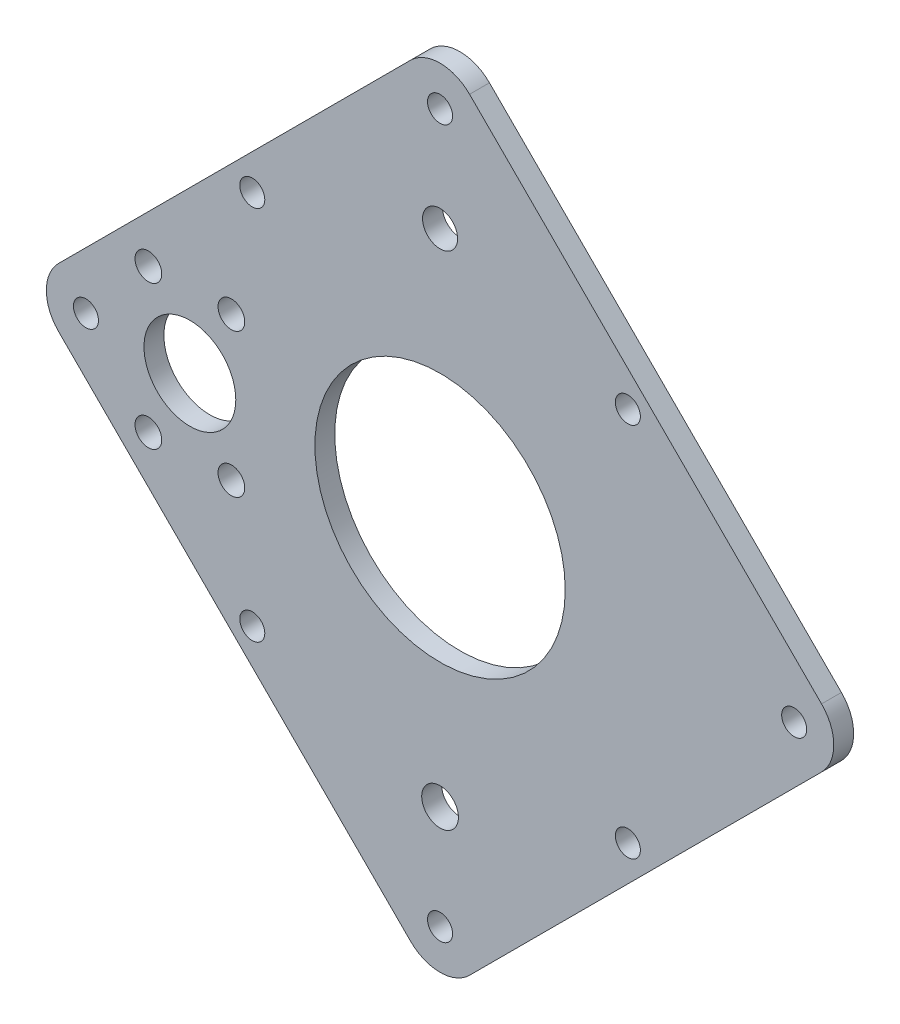
ISO-10303-21;
HEADER;
FILE_DESCRIPTION(('STEP AP214'),'2;1');
FILE_NAME('part.step','',(''),(''),'','','');
FILE_SCHEMA(('AUTOMOTIVE_DESIGN { 1 0 10303 214 1 1 1 1 }'));
ENDSEC;
DATA;
#1=APPLICATION_CONTEXT('core data for automotive mechanical design processes');
#2=APPLICATION_PROTOCOL_DEFINITION('international standard','automotive_design',2000,#1);
#3=PRODUCT_CONTEXT('',#1,'mechanical');
#4=PRODUCT('Part','Part','',(#3));
#5=PRODUCT_RELATED_PRODUCT_CATEGORY('part','',(#4));
#6=PRODUCT_DEFINITION_FORMATION('','',#4);
#7=PRODUCT_DEFINITION_CONTEXT('part definition',#1,'design');
#8=PRODUCT_DEFINITION('design','',#6,#7);
#9=PRODUCT_DEFINITION_SHAPE('','',#8);
#10=(LENGTH_UNIT() NAMED_UNIT(*) SI_UNIT(.MILLI.,.METRE.));
#11=(NAMED_UNIT(*) PLANE_ANGLE_UNIT() SI_UNIT($,.RADIAN.));
#12=(NAMED_UNIT(*) SI_UNIT($,.STERADIAN.) SOLID_ANGLE_UNIT());
#13=UNCERTAINTY_MEASURE_WITH_UNIT(LENGTH_MEASURE(1.E-05),#10,'distance_accuracy_value','');
#14=(GEOMETRIC_REPRESENTATION_CONTEXT(3) GLOBAL_UNCERTAINTY_ASSIGNED_CONTEXT((#13)) GLOBAL_UNIT_ASSIGNED_CONTEXT((#10,
#11,#12)) REPRESENTATION_CONTEXT('',''));
#15=CARTESIAN_POINT('',(0.,0.,0.));
#16=DIRECTION('',(0.,0.,1.));
#17=DIRECTION('',(1.,0.,0.));
#18=AXIS2_PLACEMENT_3D('',#15,#16,#17);
#19=CARTESIAN_POINT('',(24.6213203435596,24.6213203435596,2.38125));
#20=DIRECTION('',(0.707106781186548,0.707106781186548,0.));
#21=DIRECTION('',(-0.707106781186548,0.707106781186548,0.));
#22=AXIS2_PLACEMENT_3D('',#19,#20,#21);
#23=PLANE('',#22);
#24=DIRECTION('',(0.707106781186548,-0.707106781186548,0.));
#25=VECTOR('',#24,1.);
#26=CARTESIAN_POINT('',(24.6213203435596,24.6213203435596,2.38125));
#27=LINE('',#26,#25);
#28=CARTESIAN_POINT('',(3.53553390593274,45.7071067811865,2.38125));
#29=VERTEX_POINT('',#28);
#30=CARTESIAN_POINT('',(45.7071067811865,3.53553390593274,2.38125));
#31=VERTEX_POINT('',#30);
#32=EDGE_CURVE('E279',#29,#31,#27,.T.);
#33=ORIENTED_EDGE('',*,*,#32,.T.);
#34=DIRECTION('',(0.,0.,-1.));
#35=VECTOR('',#34,1.);
#36=CARTESIAN_POINT('',(45.7071067811865,3.53553390593274,2.38125));
#37=LINE('',#36,#35);
#38=CARTESIAN_POINT('',(45.7071067811865,3.53553390593274,0.));
#39=VERTEX_POINT('',#38);
#40=EDGE_CURVE('E10',#31,#39,#37,.T.);
#41=ORIENTED_EDGE('',*,*,#40,.T.);
#42=DIRECTION('',(0.707106781186548,-0.707106781186548,0.));
#43=VECTOR('',#42,1.);
#44=CARTESIAN_POINT('',(24.6213203435596,24.6213203435596,0.));
#45=LINE('',#44,#43);
#46=CARTESIAN_POINT('',(3.53553390593274,45.7071067811865,0.));
#47=VERTEX_POINT('',#46);
#48=EDGE_CURVE('E316',#47,#39,#45,.T.);
#49=ORIENTED_EDGE('',*,*,#48,.F.);
#50=DIRECTION('',(0.,0.,-1.));
#51=VECTOR('',#50,1.);
#52=CARTESIAN_POINT('',(3.53553390593274,45.7071067811865,2.38125));
#53=LINE('',#52,#51);
#54=EDGE_CURVE('E26',#47,#29,#53,.F.);
#55=ORIENTED_EDGE('',*,*,#54,.T.);
#56=EDGE_LOOP('',(#33,#41,#49,#55));
#57=FACE_BOUND('',#56,.T.);
#58=ADVANCED_FACE('F16',(#57),#23,.T.);
#59=CARTESIAN_POINT('',(-24.6213203435596,24.6213203435596,2.38125));
#60=DIRECTION('',(-0.707106781186548,0.707106781186548,0.));
#61=DIRECTION('',(-0.707106781186548,-0.707106781186548,0.));
#62=AXIS2_PLACEMENT_3D('',#59,#60,#61);
#63=PLANE('',#62);
#64=DIRECTION('',(0.707106781186548,0.707106781186548,0.));
#65=VECTOR('',#64,1.);
#66=CARTESIAN_POINT('',(-24.6213203435596,24.6213203435596,0.));
#67=LINE('',#66,#65);
#68=CARTESIAN_POINT('',(-45.7071067811865,3.53553390593274,0.));
#69=VERTEX_POINT('',#68);
#70=CARTESIAN_POINT('',(-3.53553390593274,45.7071067811865,0.));
#71=VERTEX_POINT('',#70);
#72=EDGE_CURVE('E129',#69,#71,#67,.T.);
#73=ORIENTED_EDGE('',*,*,#72,.F.);
#74=DIRECTION('',(0.,0.,-1.));
#75=VECTOR('',#74,1.);
#76=CARTESIAN_POINT('',(-45.7071067811865,3.53553390593274,2.38125));
#77=LINE('',#76,#75);
#78=CARTESIAN_POINT('',(-45.7071067811865,3.53553390593274,2.38125));
#79=VERTEX_POINT('',#78);
#80=EDGE_CURVE('E159',#69,#79,#77,.F.);
#81=ORIENTED_EDGE('',*,*,#80,.T.);
#82=DIRECTION('',(0.707106781186548,0.707106781186548,0.));
#83=VECTOR('',#82,1.);
#84=CARTESIAN_POINT('',(-24.6213203435596,24.6213203435596,2.38125));
#85=LINE('',#84,#83);
#86=CARTESIAN_POINT('',(-3.53553390593274,45.7071067811865,2.38125));
#87=VERTEX_POINT('',#86);
#88=EDGE_CURVE('E249',#79,#87,#85,.T.);
#89=ORIENTED_EDGE('',*,*,#88,.T.);
#90=DIRECTION('',(0.,0.,-1.));
#91=VECTOR('',#90,1.);
#92=CARTESIAN_POINT('',(-3.53553390593274,45.7071067811865,2.38125));
#93=LINE('',#92,#91);
#94=EDGE_CURVE('E155',#87,#71,#93,.T.);
#95=ORIENTED_EDGE('',*,*,#94,.T.);
#96=EDGE_LOOP('',(#73,#81,#89,#95));
#97=FACE_BOUND('',#96,.T.);
#98=ADVANCED_FACE('F350',(#97),#63,.T.);
#99=CARTESIAN_POINT('',(-24.6213203435596,-24.6213203435596,2.38125));
#100=DIRECTION('',(-0.707106781186548,-0.707106781186548,0.));
#101=DIRECTION('',(0.707106781186548,-0.707106781186548,0.));
#102=AXIS2_PLACEMENT_3D('',#99,#100,#101);
#103=PLANE('',#102);
#104=DIRECTION('',(-0.707106781186548,0.707106781186548,0.));
#105=VECTOR('',#104,1.);
#106=CARTESIAN_POINT('',(-24.6213203435596,-24.6213203435596,2.38125));
#107=LINE('',#106,#105);
#108=CARTESIAN_POINT('',(-3.53553390593273,-45.7071067811865,2.38125));
#109=VERTEX_POINT('',#108);
#110=CARTESIAN_POINT('',(-45.7071067811865,-3.53553390593274,2.38125));
#111=VERTEX_POINT('',#110);
#112=EDGE_CURVE('E253',#109,#111,#107,.T.);
#113=ORIENTED_EDGE('',*,*,#112,.T.);
#114=DIRECTION('',(0.,0.,-1.));
#115=VECTOR('',#114,1.);
#116=CARTESIAN_POINT('',(-45.7071067811865,-3.53553390593274,2.38125));
#117=LINE('',#116,#115);
#118=CARTESIAN_POINT('',(-45.7071067811865,-3.53553390593274,0.));
#119=VERTEX_POINT('',#118);
#120=EDGE_CURVE('E126',#111,#119,#117,.T.);
#121=ORIENTED_EDGE('',*,*,#120,.T.);
#122=DIRECTION('',(-0.707106781186548,0.707106781186548,0.));
#123=VECTOR('',#122,1.);
#124=CARTESIAN_POINT('',(-24.6213203435596,-24.6213203435596,0.));
#125=LINE('',#124,#123);
#126=CARTESIAN_POINT('',(-3.53553390593273,-45.7071067811865,0.));
#127=VERTEX_POINT('',#126);
#128=EDGE_CURVE('E110',#127,#119,#125,.T.);
#129=ORIENTED_EDGE('',*,*,#128,.F.);
#130=DIRECTION('',(0.,0.,-1.));
#131=VECTOR('',#130,1.);
#132=CARTESIAN_POINT('',(-3.53553390593273,-45.7071067811865,2.38125));
#133=LINE('',#132,#131);
#134=EDGE_CURVE('E124',#127,#109,#133,.F.);
#135=ORIENTED_EDGE('',*,*,#134,.T.);
#136=EDGE_LOOP('',(#113,#121,#129,#135));
#137=FACE_BOUND('',#136,.T.);
#138=ADVANCED_FACE('F123',(#137),#103,.T.);
#139=CARTESIAN_POINT('',(0.,42.4264068711928,2.38125));
#140=DIRECTION('',(0.,0.,-1.));
#141=DIRECTION('',(-1.,0.,0.));
#142=AXIS2_PLACEMENT_3D('',#139,#140,#141);
#143=CYLINDRICAL_SURFACE('',#142,1.5);
#144=CARTESIAN_POINT('',(0.,42.4264068711928,2.38125));
#145=DIRECTION('',(0.,0.,1.));
#146=DIRECTION('',(1.,0.,0.));
#147=AXIS2_PLACEMENT_3D('',#144,#145,#146);
#148=CIRCLE('',#147,1.5);
#149=CARTESIAN_POINT('',(1.49999999999999,42.4264068711928,2.38125));
#150=VERTEX_POINT('',#149);
#151=EDGE_CURVE('E143',#150,#150,#148,.T.);
#152=ORIENTED_EDGE('',*,*,#151,.T.);
#153=EDGE_LOOP('',(#152));
#154=FACE_BOUND('',#153,.T.);
#155=CARTESIAN_POINT('',(0.,42.4264068711928,0.));
#156=DIRECTION('',(0.,0.,1.));
#157=DIRECTION('',(1.,0.,0.));
#158=AXIS2_PLACEMENT_3D('',#155,#156,#157);
#159=CIRCLE('',#158,1.5);
#160=CARTESIAN_POINT('',(1.49999999999999,42.4264068711928,0.));
#161=VERTEX_POINT('',#160);
#162=EDGE_CURVE('E319',#161,#161,#159,.T.);
#163=ORIENTED_EDGE('',*,*,#162,.F.);
#164=EDGE_LOOP('',(#163));
#165=FACE_BOUND('',#164,.T.);
#166=ADVANCED_FACE('F359',(#154,#165),#143,.F.);
#167=CARTESIAN_POINT('',(42.4264068711928,0.,2.38125));
#168=DIRECTION('',(0.,0.,-1.));
#169=DIRECTION('',(-1.,0.,0.));
#170=AXIS2_PLACEMENT_3D('',#167,#168,#169);
#171=CYLINDRICAL_SURFACE('',#170,1.5);
#172=CARTESIAN_POINT('',(42.4264068711928,0.,2.38125));
#173=DIRECTION('',(0.,0.,1.));
#174=DIRECTION('',(1.,0.,0.));
#175=AXIS2_PLACEMENT_3D('',#172,#173,#174);
#176=CIRCLE('',#175,1.5);
#177=CARTESIAN_POINT('',(43.9264068711928,0.,2.38125));
#178=VERTEX_POINT('',#177);
#179=EDGE_CURVE('E275',#178,#178,#176,.T.);
#180=ORIENTED_EDGE('',*,*,#179,.T.);
#181=EDGE_LOOP('',(#180));
#182=FACE_BOUND('',#181,.T.);
#183=CARTESIAN_POINT('',(42.4264068711928,0.,0.));
#184=DIRECTION('',(0.,0.,1.));
#185=DIRECTION('',(1.,0.,0.));
#186=AXIS2_PLACEMENT_3D('',#183,#184,#185);
#187=CIRCLE('',#186,1.5);
#188=CARTESIAN_POINT('',(43.9264068711928,0.,0.));
#189=VERTEX_POINT('',#188);
#190=EDGE_CURVE('E312',#189,#189,#187,.T.);
#191=ORIENTED_EDGE('',*,*,#190,.F.);
#192=EDGE_LOOP('',(#191));
#193=FACE_BOUND('',#192,.T.);
#194=ADVANCED_FACE('F360',(#182,#193),#171,.F.);
#195=CARTESIAN_POINT('',(0.,-42.4264068711928,2.38125));
#196=DIRECTION('',(0.,0.,-1.));
#197=DIRECTION('',(-1.,0.,0.));
#198=AXIS2_PLACEMENT_3D('',#195,#196,#197);
#199=CYLINDRICAL_SURFACE('',#198,1.5);
#200=CARTESIAN_POINT('',(0.,-42.4264068711928,2.38125));
#201=DIRECTION('',(0.,0.,1.));
#202=DIRECTION('',(1.,0.,0.));
#203=AXIS2_PLACEMENT_3D('',#200,#201,#202);
#204=CIRCLE('',#203,1.5);
#205=CARTESIAN_POINT('',(1.50000000000002,-42.4264068711928,2.38125));
#206=VERTEX_POINT('',#205);
#207=EDGE_CURVE('E271',#206,#206,#204,.T.);
#208=ORIENTED_EDGE('',*,*,#207,.T.);
#209=EDGE_LOOP('',(#208));
#210=FACE_BOUND('',#209,.T.);
#211=CARTESIAN_POINT('',(0.,-42.4264068711928,0.));
#212=DIRECTION('',(0.,0.,1.));
#213=DIRECTION('',(1.,0.,0.));
#214=AXIS2_PLACEMENT_3D('',#211,#212,#213);
#215=CIRCLE('',#214,1.5);
#216=CARTESIAN_POINT('',(1.50000000000002,-42.4264068711928,0.));
#217=VERTEX_POINT('',#216);
#218=EDGE_CURVE('E308',#217,#217,#215,.T.);
#219=ORIENTED_EDGE('',*,*,#218,.F.);
#220=EDGE_LOOP('',(#219));
#221=FACE_BOUND('',#220,.T.);
#222=ADVANCED_FACE('F363',(#210,#221),#199,.F.);
#223=CARTESIAN_POINT('',(22.5,-22.5,2.38125));
#224=DIRECTION('',(0.,0.,-1.));
#225=DIRECTION('',(-1.,0.,0.));
#226=AXIS2_PLACEMENT_3D('',#223,#224,#225);
#227=CYLINDRICAL_SURFACE('',#226,1.5);
#228=CARTESIAN_POINT('',(22.5,-22.5,2.38125));
#229=DIRECTION('',(0.,0.,1.));
#230=DIRECTION('',(1.,0.,0.));
#231=AXIS2_PLACEMENT_3D('',#228,#229,#230);
#232=CIRCLE('',#231,1.5);
#233=CARTESIAN_POINT('',(24.,-22.5,2.38125));
#234=VERTEX_POINT('',#233);
#235=EDGE_CURVE('E267',#234,#234,#232,.T.);
#236=ORIENTED_EDGE('',*,*,#235,.T.);
#237=EDGE_LOOP('',(#236));
#238=FACE_BOUND('',#237,.T.);
#239=CARTESIAN_POINT('',(22.5,-22.5,0.));
#240=DIRECTION('',(0.,0.,1.));
#241=DIRECTION('',(1.,0.,0.));
#242=AXIS2_PLACEMENT_3D('',#239,#240,#241);
#243=CIRCLE('',#242,1.5);
#244=CARTESIAN_POINT('',(24.,-22.5,0.));
#245=VERTEX_POINT('',#244);
#246=EDGE_CURVE('E304',#245,#245,#243,.T.);
#247=ORIENTED_EDGE('',*,*,#246,.F.);
#248=EDGE_LOOP('',(#247));
#249=FACE_BOUND('',#248,.T.);
#250=ADVANCED_FACE('F367',(#238,#249),#227,.F.);
#251=CARTESIAN_POINT('',(-42.4264068711928,0.,2.38125));
#252=DIRECTION('',(0.,0.,-1.));
#253=DIRECTION('',(-1.,0.,0.));
#254=AXIS2_PLACEMENT_3D('',#251,#252,#253);
#255=CYLINDRICAL_SURFACE('',#254,1.5);
#256=CARTESIAN_POINT('',(-42.4264068711928,0.,2.38125));
#257=DIRECTION('',(0.,0.,1.));
#258=DIRECTION('',(1.,0.,0.));
#259=AXIS2_PLACEMENT_3D('',#256,#257,#258);
#260=CIRCLE('',#259,1.5);
#261=CARTESIAN_POINT('',(-40.9264068711928,0.,2.38125));
#262=VERTEX_POINT('',#261);
#263=EDGE_CURVE('E260',#262,#262,#260,.T.);
#264=ORIENTED_EDGE('',*,*,#263,.T.);
#265=EDGE_LOOP('',(#264));
#266=FACE_BOUND('',#265,.T.);
#267=CARTESIAN_POINT('',(-42.4264068711928,0.,0.));
#268=DIRECTION('',(0.,0.,1.));
#269=DIRECTION('',(1.,0.,0.));
#270=AXIS2_PLACEMENT_3D('',#267,#268,#269);
#271=CIRCLE('',#270,1.5);
#272=CARTESIAN_POINT('',(-40.9264068711928,0.,0.));
#273=VERTEX_POINT('',#272);
#274=EDGE_CURVE('E298',#273,#273,#271,.T.);
#275=ORIENTED_EDGE('',*,*,#274,.F.);
#276=EDGE_LOOP('',(#275));
#277=FACE_BOUND('',#276,.T.);
#278=ADVANCED_FACE('F371',(#266,#277),#255,.F.);
#279=CARTESIAN_POINT('',(-22.5,-22.5,2.38125));
#280=DIRECTION('',(0.,0.,-1.));
#281=DIRECTION('',(-1.,0.,0.));
#282=AXIS2_PLACEMENT_3D('',#279,#280,#281);
#283=CYLINDRICAL_SURFACE('',#282,1.5);
#284=CARTESIAN_POINT('',(-22.5,-22.5,2.38125));
#285=DIRECTION('',(0.,0.,1.));
#286=DIRECTION('',(1.,0.,0.));
#287=AXIS2_PLACEMENT_3D('',#284,#285,#286);
#288=CIRCLE('',#287,1.5);
#289=CARTESIAN_POINT('',(-21.,-22.5,2.38125));
#290=VERTEX_POINT('',#289);
#291=EDGE_CURVE('E256',#290,#290,#288,.T.);
#292=ORIENTED_EDGE('',*,*,#291,.T.);
#293=EDGE_LOOP('',(#292));
#294=FACE_BOUND('',#293,.T.);
#295=CARTESIAN_POINT('',(-22.5,-22.5,0.));
#296=DIRECTION('',(0.,0.,1.));
#297=DIRECTION('',(1.,0.,0.));
#298=AXIS2_PLACEMENT_3D('',#295,#296,#297);
#299=CIRCLE('',#298,1.5);
#300=CARTESIAN_POINT('',(-21.,-22.5,0.));
#301=VERTEX_POINT('',#300);
#302=EDGE_CURVE('E128',#301,#301,#299,.T.);
#303=ORIENTED_EDGE('',*,*,#302,.F.);
#304=EDGE_LOOP('',(#303));
#305=FACE_BOUND('',#304,.T.);
#306=ADVANCED_FACE('F378',(#294,#305),#283,.F.);
#307=CARTESIAN_POINT('',(-22.5,22.5,2.38125));
#308=DIRECTION('',(0.,0.,-1.));
#309=DIRECTION('',(-1.,0.,0.));
#310=AXIS2_PLACEMENT_3D('',#307,#308,#309);
#311=CYLINDRICAL_SURFACE('',#310,1.5);
#312=CARTESIAN_POINT('',(-22.5,22.5,2.38125));
#313=DIRECTION('',(0.,0.,1.));
#314=DIRECTION('',(1.,0.,0.));
#315=AXIS2_PLACEMENT_3D('',#312,#313,#314);
#316=CIRCLE('',#315,1.5);
#317=CARTESIAN_POINT('',(-21.,22.5,2.38125));
#318=VERTEX_POINT('',#317);
#319=EDGE_CURVE('E245',#318,#318,#316,.T.);
#320=ORIENTED_EDGE('',*,*,#319,.T.);
#321=EDGE_LOOP('',(#320));
#322=FACE_BOUND('',#321,.T.);
#323=CARTESIAN_POINT('',(-22.5,22.5,0.));
#324=DIRECTION('',(0.,0.,1.));
#325=DIRECTION('',(1.,0.,0.));
#326=AXIS2_PLACEMENT_3D('',#323,#324,#325);
#327=CIRCLE('',#326,1.5);
#328=CARTESIAN_POINT('',(-21.,22.5,0.));
#329=VERTEX_POINT('',#328);
#330=EDGE_CURVE('E289',#329,#329,#327,.T.);
#331=ORIENTED_EDGE('',*,*,#330,.F.);
#332=EDGE_LOOP('',(#331));
#333=FACE_BOUND('',#332,.T.);
#334=ADVANCED_FACE('F375',(#322,#333),#311,.F.);
#335=CARTESIAN_POINT('',(24.6213203435596,-24.6213203435596,2.38125));
#336=DIRECTION('',(0.707106781186548,-0.707106781186548,0.));
#337=DIRECTION('',(0.707106781186548,0.707106781186548,0.));
#338=AXIS2_PLACEMENT_3D('',#335,#336,#337);
#339=PLANE('',#338);
#340=DIRECTION('',(-0.707106781186548,-0.707106781186548,0.));
#341=VECTOR('',#340,1.);
#342=CARTESIAN_POINT('',(24.6213203435596,-24.6213203435596,2.38125));
#343=LINE('',#342,#341);
#344=CARTESIAN_POINT('',(45.7071067811865,-3.53553390593274,2.38125));
#345=VERTEX_POINT('',#344);
#346=CARTESIAN_POINT('',(3.53553390593274,-45.7071067811865,2.38125));
#347=VERTEX_POINT('',#346);
#348=EDGE_CURVE('E264',#345,#347,#343,.T.);
#349=ORIENTED_EDGE('',*,*,#348,.T.);
#350=DIRECTION('',(0.,0.,-1.));
#351=VECTOR('',#350,1.);
#352=CARTESIAN_POINT('',(3.53553390593274,-45.7071067811865,2.38125));
#353=LINE('',#352,#351);
#354=CARTESIAN_POINT('',(3.53553390593274,-45.7071067811865,0.));
#355=VERTEX_POINT('',#354);
#356=EDGE_CURVE('E175',#347,#355,#353,.T.);
#357=ORIENTED_EDGE('',*,*,#356,.T.);
#358=DIRECTION('',(-0.707106781186548,-0.707106781186548,0.));
#359=VECTOR('',#358,1.);
#360=CARTESIAN_POINT('',(24.6213203435596,-24.6213203435596,0.));
#361=LINE('',#360,#359);
#362=CARTESIAN_POINT('',(45.7071067811865,-3.53553390593274,0.));
#363=VERTEX_POINT('',#362);
#364=EDGE_CURVE('E111',#363,#355,#361,.T.);
#365=ORIENTED_EDGE('',*,*,#364,.F.);
#366=DIRECTION('',(0.,0.,-1.));
#367=VECTOR('',#366,1.);
#368=CARTESIAN_POINT('',(45.7071067811865,-3.53553390593274,2.38125));
#369=LINE('',#368,#367);
#370=EDGE_CURVE('E50',#363,#345,#369,.F.);
#371=ORIENTED_EDGE('',*,*,#370,.T.);
#372=EDGE_LOOP('',(#349,#357,#365,#371));
#373=FACE_BOUND('',#372,.T.);
#374=ADVANCED_FACE('F344',(#373),#339,.T.);
#375=CARTESIAN_POINT('',(22.5,22.5,2.38125));
#376=DIRECTION('',(0.,0.,-1.));
#377=DIRECTION('',(-1.,0.,0.));
#378=AXIS2_PLACEMENT_3D('',#375,#376,#377);
#379=CYLINDRICAL_SURFACE('',#378,1.5);
#380=CARTESIAN_POINT('',(22.5,22.5,2.38125));
#381=DIRECTION('',(0.,0.,1.));
#382=DIRECTION('',(1.,0.,0.));
#383=AXIS2_PLACEMENT_3D('',#380,#381,#382);
#384=CIRCLE('',#383,1.5);
#385=CARTESIAN_POINT('',(24.,22.5,2.38125));
#386=VERTEX_POINT('',#385);
#387=EDGE_CURVE('E241',#386,#386,#384,.T.);
#388=ORIENTED_EDGE('',*,*,#387,.T.);
#389=EDGE_LOOP('',(#388));
#390=FACE_BOUND('',#389,.T.);
#391=CARTESIAN_POINT('',(22.5,22.5,0.));
#392=DIRECTION('',(0.,0.,1.));
#393=DIRECTION('',(1.,0.,0.));
#394=AXIS2_PLACEMENT_3D('',#391,#392,#393);
#395=CIRCLE('',#394,1.5);
#396=CARTESIAN_POINT('',(24.,22.5,0.));
#397=VERTEX_POINT('',#396);
#398=EDGE_CURVE('E199',#397,#397,#395,.T.);
#399=ORIENTED_EDGE('',*,*,#398,.F.);
#400=EDGE_LOOP('',(#399));
#401=FACE_BOUND('',#400,.T.);
#402=ADVANCED_FACE('F334',(#390,#401),#379,.F.);
#403=CARTESIAN_POINT('',(0.,0.,2.38125));
#404=DIRECTION('',(0.,0.,-1.));
#405=DIRECTION('',(-1.,0.,0.));
#406=AXIS2_PLACEMENT_3D('',#403,#404,#405);
#407=CYLINDRICAL_SURFACE('',#406,15.);
#408=CARTESIAN_POINT('',(0.,0.,2.38125));
#409=DIRECTION('',(0.,0.,1.));
#410=DIRECTION('',(1.,0.,0.));
#411=AXIS2_PLACEMENT_3D('',#408,#409,#410);
#412=CIRCLE('',#411,15.);
#413=CARTESIAN_POINT('',(15.,0.,2.38125));
#414=VERTEX_POINT('',#413);
#415=EDGE_CURVE('E133',#414,#414,#412,.T.);
#416=ORIENTED_EDGE('',*,*,#415,.T.);
#417=EDGE_LOOP('',(#416));
#418=FACE_BOUND('',#417,.T.);
#419=CARTESIAN_POINT('',(0.,0.,0.));
#420=DIRECTION('',(0.,0.,1.));
#421=DIRECTION('',(1.,0.,0.));
#422=AXIS2_PLACEMENT_3D('',#419,#420,#421);
#423=CIRCLE('',#422,15.);
#424=CARTESIAN_POINT('',(15.,0.,0.));
#425=VERTEX_POINT('',#424);
#426=EDGE_CURVE('E146',#425,#425,#423,.T.);
#427=ORIENTED_EDGE('',*,*,#426,.F.);
#428=EDGE_LOOP('',(#427));
#429=FACE_BOUND('',#428,.T.);
#430=ADVANCED_FACE('F331',(#418,#429),#407,.F.);
#431=CARTESIAN_POINT('',(0.,0.,2.38125));
#432=DIRECTION('',(0.,0.,1.));
#433=DIRECTION('',(1.,0.,0.));
#434=AXIS2_PLACEMENT_3D('',#431,#432,#433);
#435=PLANE('',#434);
#436=CARTESIAN_POINT('',(0.,30.,2.38125));
#437=DIRECTION('',(0.,0.,1.));
#438=DIRECTION('',(1.,0.,0.));
#439=AXIS2_PLACEMENT_3D('',#436,#437,#438);
#440=CIRCLE('',#439,2.1);
#441=CARTESIAN_POINT('',(2.1,30.,2.38125));
#442=VERTEX_POINT('',#441);
#443=EDGE_CURVE('E203',#442,#442,#440,.T.);
#444=ORIENTED_EDGE('',*,*,#443,.F.);
#445=EDGE_LOOP('',(#444));
#446=FACE_BOUND('',#445,.T.);
#447=CARTESIAN_POINT('',(0.,-30.,2.38125));
#448=DIRECTION('',(0.,0.,1.));
#449=DIRECTION('',(1.,0.,0.));
#450=AXIS2_PLACEMENT_3D('',#447,#448,#449);
#451=CIRCLE('',#450,2.2);
#452=CARTESIAN_POINT('',(2.2,-30.,2.38125));
#453=VERTEX_POINT('',#452);
#454=EDGE_CURVE('E213',#453,#453,#451,.T.);
#455=ORIENTED_EDGE('',*,*,#454,.F.);
#456=EDGE_LOOP('',(#455));
#457=FACE_BOUND('',#456,.T.);
#458=CARTESIAN_POINT('',(-29.974,0.,2.38125));
#459=DIRECTION('',(0.,0.,1.));
#460=DIRECTION('',(1.,0.,0.));
#461=AXIS2_PLACEMENT_3D('',#458,#459,#460);
#462=CIRCLE('',#461,5.5);
#463=CARTESIAN_POINT('',(-24.474,0.,2.38125));
#464=VERTEX_POINT('',#463);
#465=EDGE_CURVE('E231',#464,#464,#462,.T.);
#466=ORIENTED_EDGE('',*,*,#465,.F.);
#467=EDGE_LOOP('',(#466));
#468=FACE_BOUND('',#467,.T.);
#469=CARTESIAN_POINT('',(-34.948,-8.614,2.38125));
#470=DIRECTION('',(0.,0.,1.));
#471=DIRECTION('',(1.,0.,0.));
#472=AXIS2_PLACEMENT_3D('',#469,#470,#471);
#473=CIRCLE('',#472,1.6);
#474=CARTESIAN_POINT('',(-33.348,-8.614,2.38125));
#475=VERTEX_POINT('',#474);
#476=EDGE_CURVE('E227',#475,#475,#473,.T.);
#477=ORIENTED_EDGE('',*,*,#476,.F.);
#478=EDGE_LOOP('',(#477));
#479=FACE_BOUND('',#478,.T.);
#480=CARTESIAN_POINT('',(-34.948,8.614,2.38125));
#481=DIRECTION('',(0.,0.,1.));
#482=DIRECTION('',(1.,0.,0.));
#483=AXIS2_PLACEMENT_3D('',#480,#481,#482);
#484=CIRCLE('',#483,1.6);
#485=CARTESIAN_POINT('',(-33.348,8.614,2.38125));
#486=VERTEX_POINT('',#485);
#487=EDGE_CURVE('E223',#486,#486,#484,.T.);
#488=ORIENTED_EDGE('',*,*,#487,.F.);
#489=EDGE_LOOP('',(#488));
#490=FACE_BOUND('',#489,.T.);
#491=CARTESIAN_POINT('',(-25.,-8.614,2.38125));
#492=DIRECTION('',(0.,0.,1.));
#493=DIRECTION('',(1.,0.,0.));
#494=AXIS2_PLACEMENT_3D('',#491,#492,#493);
#495=CIRCLE('',#494,1.6);
#496=CARTESIAN_POINT('',(-23.4,-8.614,2.38125));
#497=VERTEX_POINT('',#496);
#498=EDGE_CURVE('E210',#497,#497,#495,.T.);
#499=ORIENTED_EDGE('',*,*,#498,.F.);
#500=EDGE_LOOP('',(#499));
#501=FACE_BOUND('',#500,.T.);
#502=CARTESIAN_POINT('',(-25.,8.614,2.38125));
#503=DIRECTION('',(0.,0.,1.));
#504=DIRECTION('',(1.,0.,0.));
#505=AXIS2_PLACEMENT_3D('',#502,#503,#504);
#506=CIRCLE('',#505,1.6);
#507=CARTESIAN_POINT('',(-23.4,8.614,2.38125));
#508=VERTEX_POINT('',#507);
#509=EDGE_CURVE('E184',#508,#508,#506,.T.);
#510=ORIENTED_EDGE('',*,*,#509,.F.);
#511=EDGE_LOOP('',(#510));
#512=FACE_BOUND('',#511,.T.);
#513=ORIENTED_EDGE('',*,*,#387,.F.);
#514=EDGE_LOOP('',(#513));
#515=FACE_BOUND('',#514,.T.);
#516=ORIENTED_EDGE('',*,*,#88,.F.);
#517=CARTESIAN_POINT('',(-42.1715728752538,0.,2.38125));
#518=DIRECTION('',(0.,0.,1.));
#519=DIRECTION('',(1.,0.,0.));
#520=AXIS2_PLACEMENT_3D('',#517,#518,#519);
#521=CIRCLE('',#520,5.);
#522=EDGE_CURVE('E170',#79,#111,#521,.T.);
#523=ORIENTED_EDGE('',*,*,#522,.T.);
#524=ORIENTED_EDGE('',*,*,#112,.F.);
#525=CARTESIAN_POINT('',(0.,-42.1715728752538,2.38125));
#526=DIRECTION('',(0.,0.,1.));
#527=DIRECTION('',(1.,0.,0.));
#528=AXIS2_PLACEMENT_3D('',#525,#526,#527);
#529=CIRCLE('',#528,5.);
#530=EDGE_CURVE('E39',#109,#347,#529,.T.);
#531=ORIENTED_EDGE('',*,*,#530,.T.);
#532=ORIENTED_EDGE('',*,*,#348,.F.);
#533=CARTESIAN_POINT('',(42.1715728752538,0.,2.38125));
#534=DIRECTION('',(0.,0.,1.));
#535=DIRECTION('',(1.,0.,0.));
#536=AXIS2_PLACEMENT_3D('',#533,#534,#535);
#537=CIRCLE('',#536,5.);
#538=EDGE_CURVE('E165',#345,#31,#537,.T.);
#539=ORIENTED_EDGE('',*,*,#538,.T.);
#540=ORIENTED_EDGE('',*,*,#32,.F.);
#541=CARTESIAN_POINT('',(0.,42.1715728752538,2.38125));
#542=DIRECTION('',(0.,0.,1.));
#543=DIRECTION('',(1.,0.,0.));
#544=AXIS2_PLACEMENT_3D('',#541,#542,#543);
#545=CIRCLE('',#544,5.);
#546=EDGE_CURVE('E162',#29,#87,#545,.T.);
#547=ORIENTED_EDGE('',*,*,#546,.T.);
#548=EDGE_LOOP('',(#516,#523,#524,#531,#532,#539,#540,#547));
#549=FACE_BOUND('',#548,.T.);
#550=ORIENTED_EDGE('',*,*,#319,.F.);
#551=EDGE_LOOP('',(#550));
#552=FACE_BOUND('',#551,.T.);
#553=ORIENTED_EDGE('',*,*,#291,.F.);
#554=EDGE_LOOP('',(#553));
#555=FACE_BOUND('',#554,.T.);
#556=ORIENTED_EDGE('',*,*,#263,.F.);
#557=EDGE_LOOP('',(#556));
#558=FACE_BOUND('',#557,.T.);
#559=ORIENTED_EDGE('',*,*,#235,.F.);
#560=EDGE_LOOP('',(#559));
#561=FACE_BOUND('',#560,.T.);
#562=ORIENTED_EDGE('',*,*,#207,.F.);
#563=EDGE_LOOP('',(#562));
#564=FACE_BOUND('',#563,.T.);
#565=ORIENTED_EDGE('',*,*,#179,.F.);
#566=EDGE_LOOP('',(#565));
#567=FACE_BOUND('',#566,.T.);
#568=ORIENTED_EDGE('',*,*,#151,.F.);
#569=EDGE_LOOP('',(#568));
#570=FACE_BOUND('',#569,.T.);
#571=ORIENTED_EDGE('',*,*,#415,.F.);
#572=EDGE_LOOP('',(#571));
#573=FACE_BOUND('',#572,.T.);
#574=ADVANCED_FACE('F333',(#446,#457,#468,#479,#490,#501,#512,#515,#549,#552,#555,#558,#561,
#564,#567,#570,#573),#435,.T.);
#575=CARTESIAN_POINT('',(0.,0.,0.));
#576=DIRECTION('',(0.,0.,1.));
#577=DIRECTION('',(1.,0.,0.));
#578=AXIS2_PLACEMENT_3D('',#575,#576,#577);
#579=PLANE('',#578);
#580=CARTESIAN_POINT('',(0.,30.,0.));
#581=DIRECTION('',(0.,0.,1.));
#582=DIRECTION('',(1.,0.,0.));
#583=AXIS2_PLACEMENT_3D('',#580,#581,#582);
#584=CIRCLE('',#583,2.1);
#585=CARTESIAN_POINT('',(2.1,30.,0.));
#586=VERTEX_POINT('',#585);
#587=EDGE_CURVE('E20',#586,#586,#584,.T.);
#588=ORIENTED_EDGE('',*,*,#587,.T.);
#589=EDGE_LOOP('',(#588));
#590=FACE_BOUND('',#589,.T.);
#591=CARTESIAN_POINT('',(0.,-30.,0.));
#592=DIRECTION('',(0.,0.,1.));
#593=DIRECTION('',(1.,0.,0.));
#594=AXIS2_PLACEMENT_3D('',#591,#592,#593);
#595=CIRCLE('',#594,2.2);
#596=CARTESIAN_POINT('',(2.2,-30.,0.));
#597=VERTEX_POINT('',#596);
#598=EDGE_CURVE('E200',#597,#597,#595,.T.);
#599=ORIENTED_EDGE('',*,*,#598,.T.);
#600=EDGE_LOOP('',(#599));
#601=FACE_BOUND('',#600,.T.);
#602=CARTESIAN_POINT('',(-29.974,0.,0.));
#603=DIRECTION('',(0.,0.,1.));
#604=DIRECTION('',(1.,0.,0.));
#605=AXIS2_PLACEMENT_3D('',#602,#603,#604);
#606=CIRCLE('',#605,5.5);
#607=CARTESIAN_POINT('',(-24.474,0.,0.));
#608=VERTEX_POINT('',#607);
#609=EDGE_CURVE('E196',#608,#608,#606,.T.);
#610=ORIENTED_EDGE('',*,*,#609,.T.);
#611=EDGE_LOOP('',(#610));
#612=FACE_BOUND('',#611,.T.);
#613=CARTESIAN_POINT('',(-34.948,-8.614,0.));
#614=DIRECTION('',(0.,0.,1.));
#615=DIRECTION('',(1.,0.,0.));
#616=AXIS2_PLACEMENT_3D('',#613,#614,#615);
#617=CIRCLE('',#616,1.6);
#618=CARTESIAN_POINT('',(-33.348,-8.614,0.));
#619=VERTEX_POINT('',#618);
#620=EDGE_CURVE('E192',#619,#619,#617,.T.);
#621=ORIENTED_EDGE('',*,*,#620,.T.);
#622=EDGE_LOOP('',(#621));
#623=FACE_BOUND('',#622,.T.);
#624=CARTESIAN_POINT('',(-34.948,8.614,0.));
#625=DIRECTION('',(0.,0.,1.));
#626=DIRECTION('',(1.,0.,0.));
#627=AXIS2_PLACEMENT_3D('',#624,#625,#626);
#628=CIRCLE('',#627,1.6);
#629=CARTESIAN_POINT('',(-33.348,8.614,0.));
#630=VERTEX_POINT('',#629);
#631=EDGE_CURVE('E188',#630,#630,#628,.T.);
#632=ORIENTED_EDGE('',*,*,#631,.T.);
#633=EDGE_LOOP('',(#632));
#634=FACE_BOUND('',#633,.T.);
#635=CARTESIAN_POINT('',(-25.,-8.614,0.));
#636=DIRECTION('',(0.,0.,1.));
#637=DIRECTION('',(1.,0.,0.));
#638=AXIS2_PLACEMENT_3D('',#635,#636,#637);
#639=CIRCLE('',#638,1.6);
#640=CARTESIAN_POINT('',(-23.4,-8.614,0.));
#641=VERTEX_POINT('',#640);
#642=EDGE_CURVE('E183',#641,#641,#639,.T.);
#643=ORIENTED_EDGE('',*,*,#642,.T.);
#644=EDGE_LOOP('',(#643));
#645=FACE_BOUND('',#644,.T.);
#646=CARTESIAN_POINT('',(-25.,8.614,0.));
#647=DIRECTION('',(0.,0.,1.));
#648=DIRECTION('',(1.,0.,0.));
#649=AXIS2_PLACEMENT_3D('',#646,#647,#648);
#650=CIRCLE('',#649,1.6);
#651=CARTESIAN_POINT('',(-23.4,8.614,0.));
#652=VERTEX_POINT('',#651);
#653=EDGE_CURVE('E179',#652,#652,#650,.T.);
#654=ORIENTED_EDGE('',*,*,#653,.T.);
#655=EDGE_LOOP('',(#654));
#656=FACE_BOUND('',#655,.T.);
#657=ORIENTED_EDGE('',*,*,#398,.T.);
#658=EDGE_LOOP('',(#657));
#659=FACE_BOUND('',#658,.T.);
#660=ORIENTED_EDGE('',*,*,#128,.T.);
#661=CARTESIAN_POINT('',(-42.1715728752538,0.,0.));
#662=DIRECTION('',(0.,0.,1.));
#663=DIRECTION('',(1.,0.,0.));
#664=AXIS2_PLACEMENT_3D('',#661,#662,#663);
#665=CIRCLE('',#664,5.);
#666=EDGE_CURVE('E117',#119,#69,#665,.F.);
#667=ORIENTED_EDGE('',*,*,#666,.T.);
#668=ORIENTED_EDGE('',*,*,#72,.T.);
#669=CARTESIAN_POINT('',(0.,42.1715728752538,0.));
#670=DIRECTION('',(0.,0.,1.));
#671=DIRECTION('',(1.,0.,0.));
#672=AXIS2_PLACEMENT_3D('',#669,#670,#671);
#673=CIRCLE('',#672,5.);
#674=EDGE_CURVE('E139',#71,#47,#673,.F.);
#675=ORIENTED_EDGE('',*,*,#674,.T.);
#676=ORIENTED_EDGE('',*,*,#48,.T.);
#677=CARTESIAN_POINT('',(42.1715728752538,0.,0.));
#678=DIRECTION('',(0.,0.,1.));
#679=DIRECTION('',(1.,0.,0.));
#680=AXIS2_PLACEMENT_3D('',#677,#678,#679);
#681=CIRCLE('',#680,5.);
#682=EDGE_CURVE('E118',#39,#363,#681,.F.);
#683=ORIENTED_EDGE('',*,*,#682,.T.);
#684=ORIENTED_EDGE('',*,*,#364,.T.);
#685=CARTESIAN_POINT('',(0.,-42.1715728752538,0.));
#686=DIRECTION('',(0.,0.,1.));
#687=DIRECTION('',(1.,0.,0.));
#688=AXIS2_PLACEMENT_3D('',#685,#686,#687);
#689=CIRCLE('',#688,5.);
#690=EDGE_CURVE('E106',#355,#127,#689,.F.);
#691=ORIENTED_EDGE('',*,*,#690,.T.);
#692=EDGE_LOOP('',(#660,#667,#668,#675,#676,#683,#684,#691));
#693=FACE_BOUND('',#692,.T.);
#694=ORIENTED_EDGE('',*,*,#330,.T.);
#695=EDGE_LOOP('',(#694));
#696=FACE_BOUND('',#695,.T.);
#697=ORIENTED_EDGE('',*,*,#302,.T.);
#698=EDGE_LOOP('',(#697));
#699=FACE_BOUND('',#698,.T.);
#700=ORIENTED_EDGE('',*,*,#274,.T.);
#701=EDGE_LOOP('',(#700));
#702=FACE_BOUND('',#701,.T.);
#703=ORIENTED_EDGE('',*,*,#246,.T.);
#704=EDGE_LOOP('',(#703));
#705=FACE_BOUND('',#704,.T.);
#706=ORIENTED_EDGE('',*,*,#218,.T.);
#707=EDGE_LOOP('',(#706));
#708=FACE_BOUND('',#707,.T.);
#709=ORIENTED_EDGE('',*,*,#190,.T.);
#710=EDGE_LOOP('',(#709));
#711=FACE_BOUND('',#710,.T.);
#712=ORIENTED_EDGE('',*,*,#162,.T.);
#713=EDGE_LOOP('',(#712));
#714=FACE_BOUND('',#713,.T.);
#715=ORIENTED_EDGE('',*,*,#426,.T.);
#716=EDGE_LOOP('',(#715));
#717=FACE_BOUND('',#716,.T.);
#718=ADVANCED_FACE('F108',(#590,#601,#612,#623,#634,#645,#656,#659,#693,#696,#699,#702,#705,
#708,#711,#714,#717),#579,.F.);
#719=CARTESIAN_POINT('',(-42.1715728752538,0.,2.38125));
#720=DIRECTION('',(0.,0.,-1.));
#721=DIRECTION('',(-1.,0.,0.));
#722=AXIS2_PLACEMENT_3D('',#719,#720,#721);
#723=CYLINDRICAL_SURFACE('',#722,5.);
#724=ORIENTED_EDGE('',*,*,#522,.F.);
#725=ORIENTED_EDGE('',*,*,#80,.F.);
#726=ORIENTED_EDGE('',*,*,#666,.F.);
#727=ORIENTED_EDGE('',*,*,#120,.F.);
#728=EDGE_LOOP('',(#724,#725,#726,#727));
#729=FACE_BOUND('',#728,.T.);
#730=ADVANCED_FACE('F388',(#729),#723,.T.);
#731=CARTESIAN_POINT('',(0.,-42.1715728752538,2.38125));
#732=DIRECTION('',(0.,0.,-1.));
#733=DIRECTION('',(-1.,0.,0.));
#734=AXIS2_PLACEMENT_3D('',#731,#732,#733);
#735=CYLINDRICAL_SURFACE('',#734,5.);
#736=ORIENTED_EDGE('',*,*,#530,.F.);
#737=ORIENTED_EDGE('',*,*,#134,.F.);
#738=ORIENTED_EDGE('',*,*,#690,.F.);
#739=ORIENTED_EDGE('',*,*,#356,.F.);
#740=EDGE_LOOP('',(#736,#737,#738,#739));
#741=FACE_BOUND('',#740,.T.);
#742=ADVANCED_FACE('F131',(#741),#735,.T.);
#743=CARTESIAN_POINT('',(42.1715728752538,0.,2.38125));
#744=DIRECTION('',(0.,0.,-1.));
#745=DIRECTION('',(-1.,0.,0.));
#746=AXIS2_PLACEMENT_3D('',#743,#744,#745);
#747=CYLINDRICAL_SURFACE('',#746,5.);
#748=ORIENTED_EDGE('',*,*,#538,.F.);
#749=ORIENTED_EDGE('',*,*,#370,.F.);
#750=ORIENTED_EDGE('',*,*,#682,.F.);
#751=ORIENTED_EDGE('',*,*,#40,.F.);
#752=EDGE_LOOP('',(#748,#749,#750,#751));
#753=FACE_BOUND('',#752,.T.);
#754=ADVANCED_FACE('F393',(#753),#747,.T.);
#755=CARTESIAN_POINT('',(0.,42.1715728752538,2.38125));
#756=DIRECTION('',(0.,0.,-1.));
#757=DIRECTION('',(-1.,0.,0.));
#758=AXIS2_PLACEMENT_3D('',#755,#756,#757);
#759=CYLINDRICAL_SURFACE('',#758,5.);
#760=ORIENTED_EDGE('',*,*,#546,.F.);
#761=ORIENTED_EDGE('',*,*,#54,.F.);
#762=ORIENTED_EDGE('',*,*,#674,.F.);
#763=ORIENTED_EDGE('',*,*,#94,.F.);
#764=EDGE_LOOP('',(#760,#761,#762,#763));
#765=FACE_BOUND('',#764,.T.);
#766=ADVANCED_FACE('F18',(#765),#759,.T.);
#767=CARTESIAN_POINT('',(-25.,8.614,-22.61875));
#768=DIRECTION('',(0.,0.,1.));
#769=DIRECTION('',(1.,0.,0.));
#770=AXIS2_PLACEMENT_3D('',#767,#768,#769);
#771=CYLINDRICAL_SURFACE('',#770,1.6);
#772=ORIENTED_EDGE('',*,*,#509,.T.);
#773=EDGE_LOOP('',(#772));
#774=FACE_BOUND('',#773,.T.);
#775=ORIENTED_EDGE('',*,*,#653,.F.);
#776=EDGE_LOOP('',(#775));
#777=FACE_BOUND('',#776,.T.);
#778=ADVANCED_FACE('F399',(#774,#777),#771,.F.);
#779=CARTESIAN_POINT('',(-25.,-8.614,-22.61875));
#780=DIRECTION('',(0.,0.,1.));
#781=DIRECTION('',(1.,0.,0.));
#782=AXIS2_PLACEMENT_3D('',#779,#780,#781);
#783=CYLINDRICAL_SURFACE('',#782,1.6);
#784=ORIENTED_EDGE('',*,*,#498,.T.);
#785=EDGE_LOOP('',(#784));
#786=FACE_BOUND('',#785,.T.);
#787=ORIENTED_EDGE('',*,*,#642,.F.);
#788=EDGE_LOOP('',(#787));
#789=FACE_BOUND('',#788,.T.);
#790=ADVANCED_FACE('F485',(#786,#789),#783,.F.);
#791=CARTESIAN_POINT('',(-34.948,8.614,-22.61875));
#792=DIRECTION('',(0.,0.,1.));
#793=DIRECTION('',(1.,0.,0.));
#794=AXIS2_PLACEMENT_3D('',#791,#792,#793);
#795=CYLINDRICAL_SURFACE('',#794,1.6);
#796=ORIENTED_EDGE('',*,*,#487,.T.);
#797=EDGE_LOOP('',(#796));
#798=FACE_BOUND('',#797,.T.);
#799=ORIENTED_EDGE('',*,*,#631,.F.);
#800=EDGE_LOOP('',(#799));
#801=FACE_BOUND('',#800,.T.);
#802=ADVANCED_FACE('F480',(#798,#801),#795,.F.);
#803=CARTESIAN_POINT('',(-34.948,-8.614,-22.61875));
#804=DIRECTION('',(0.,0.,1.));
#805=DIRECTION('',(1.,0.,0.));
#806=AXIS2_PLACEMENT_3D('',#803,#804,#805);
#807=CYLINDRICAL_SURFACE('',#806,1.6);
#808=ORIENTED_EDGE('',*,*,#476,.T.);
#809=EDGE_LOOP('',(#808));
#810=FACE_BOUND('',#809,.T.);
#811=ORIENTED_EDGE('',*,*,#620,.F.);
#812=EDGE_LOOP('',(#811));
#813=FACE_BOUND('',#812,.T.);
#814=ADVANCED_FACE('F484',(#810,#813),#807,.F.);
#815=CARTESIAN_POINT('',(-29.974,0.,-22.61875));
#816=DIRECTION('',(0.,0.,1.));
#817=DIRECTION('',(1.,0.,0.));
#818=AXIS2_PLACEMENT_3D('',#815,#816,#817);
#819=CYLINDRICAL_SURFACE('',#818,5.5);
#820=ORIENTED_EDGE('',*,*,#465,.T.);
#821=EDGE_LOOP('',(#820));
#822=FACE_BOUND('',#821,.T.);
#823=ORIENTED_EDGE('',*,*,#609,.F.);
#824=EDGE_LOOP('',(#823));
#825=FACE_BOUND('',#824,.T.);
#826=ADVANCED_FACE('F504',(#822,#825),#819,.F.);
#827=CARTESIAN_POINT('',(0.,-30.,-22.61875));
#828=DIRECTION('',(0.,0.,1.));
#829=DIRECTION('',(1.,0.,0.));
#830=AXIS2_PLACEMENT_3D('',#827,#828,#829);
#831=CYLINDRICAL_SURFACE('',#830,2.2);
#832=ORIENTED_EDGE('',*,*,#454,.T.);
#833=EDGE_LOOP('',(#832));
#834=FACE_BOUND('',#833,.T.);
#835=ORIENTED_EDGE('',*,*,#598,.F.);
#836=EDGE_LOOP('',(#835));
#837=FACE_BOUND('',#836,.T.);
#838=ADVANCED_FACE('F510',(#834,#837),#831,.F.);
#839=CARTESIAN_POINT('',(0.,30.,-22.61875));
#840=DIRECTION('',(0.,0.,1.));
#841=DIRECTION('',(1.,0.,0.));
#842=AXIS2_PLACEMENT_3D('',#839,#840,#841);
#843=CYLINDRICAL_SURFACE('',#842,2.1);
#844=ORIENTED_EDGE('',*,*,#443,.T.);
#845=EDGE_LOOP('',(#844));
#846=FACE_BOUND('',#845,.T.);
#847=ORIENTED_EDGE('',*,*,#587,.F.);
#848=EDGE_LOOP('',(#847));
#849=FACE_BOUND('',#848,.T.);
#850=ADVANCED_FACE('F523',(#846,#849),#843,.F.);
#851=CLOSED_SHELL('',(#58,#98,#138,#166,#194,#222,#250,#278,#306,#334,#374,#402,#430,#574,#718,
#730,#742,#754,#766,#778,#790,#802,#814,#826,#838,#850));
#852=MANIFOLD_SOLID_BREP('B1',#851);
#853=ADVANCED_BREP_SHAPE_REPRESENTATION('',(#18,#852),#14);
#854=SHAPE_DEFINITION_REPRESENTATION(#9,#853);
ENDSEC;
END-ISO-10303-21;
